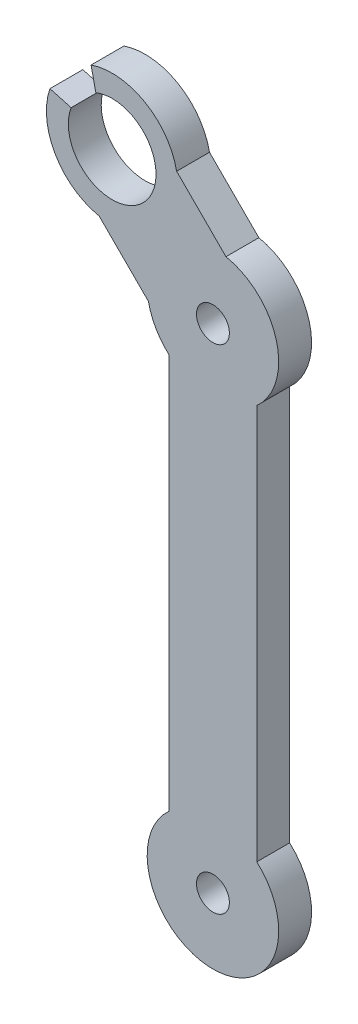
ISO-10303-21;
HEADER;
FILE_DESCRIPTION(('STEP AP214'),'2;1');
FILE_NAME('part.step','',(''),(''),'','','');
FILE_SCHEMA(('AUTOMOTIVE_DESIGN { 1 0 10303 214 1 1 1 1 }'));
ENDSEC;
DATA;
#1=APPLICATION_CONTEXT('core data for automotive mechanical design processes');
#2=APPLICATION_PROTOCOL_DEFINITION('international standard','automotive_design',2000,#1);
#3=PRODUCT_CONTEXT('',#1,'mechanical');
#4=PRODUCT('Part','Part','',(#3));
#5=PRODUCT_RELATED_PRODUCT_CATEGORY('part','',(#4));
#6=PRODUCT_DEFINITION_FORMATION('','',#4);
#7=PRODUCT_DEFINITION_CONTEXT('part definition',#1,'design');
#8=PRODUCT_DEFINITION('design','',#6,#7);
#9=PRODUCT_DEFINITION_SHAPE('','',#8);
#10=(LENGTH_UNIT() NAMED_UNIT(*) SI_UNIT(.MILLI.,.METRE.));
#11=(NAMED_UNIT(*) PLANE_ANGLE_UNIT() SI_UNIT($,.RADIAN.));
#12=(NAMED_UNIT(*) SI_UNIT($,.STERADIAN.) SOLID_ANGLE_UNIT());
#13=UNCERTAINTY_MEASURE_WITH_UNIT(LENGTH_MEASURE(1.E-05),#10,'distance_accuracy_value','');
#14=(GEOMETRIC_REPRESENTATION_CONTEXT(3) GLOBAL_UNCERTAINTY_ASSIGNED_CONTEXT((#13)) GLOBAL_UNIT_ASSIGNED_CONTEXT((#10,
#11,#12)) REPRESENTATION_CONTEXT('',''));
#15=CARTESIAN_POINT('',(0.,0.,0.));
#16=DIRECTION('',(0.,0.,1.));
#17=DIRECTION('',(1.,0.,0.));
#18=AXIS2_PLACEMENT_3D('',#15,#16,#17);
#19=CARTESIAN_POINT('',(0.,45.,3.));
#20=DIRECTION('',(0.,0.,-1.));
#21=DIRECTION('',(-1.,0.,0.));
#22=AXIS2_PLACEMENT_3D('',#19,#20,#21);
#23=CYLINDRICAL_SURFACE('',#22,6.);
#24=CARTESIAN_POINT('',(0.,45.,0.));
#25=DIRECTION('',(0.,0.,1.));
#26=DIRECTION('',(1.,0.,0.));
#27=AXIS2_PLACEMENT_3D('',#24,#25,#26);
#28=CIRCLE('',#27,6.);
#29=CARTESIAN_POINT('',(4.,40.5278640450004,0.));
#30=VERTEX_POINT('',#29);
#31=CARTESIAN_POINT('',(1.19032602602106,50.8807417858444,0.));
#32=VERTEX_POINT('',#31);
#33=EDGE_CURVE('E162',#30,#32,#28,.T.);
#34=ORIENTED_EDGE('',*,*,#33,.T.);
#35=DIRECTION('',(0.,0.,-1.));
#36=VECTOR('',#35,1.);
#37=CARTESIAN_POINT('',(1.19032602602106,50.8807417858444,3.));
#38=LINE('',#37,#36);
#39=CARTESIAN_POINT('',(1.19032602602106,50.8807417858444,3.));
#40=VERTEX_POINT('',#39);
#41=EDGE_CURVE('E11',#40,#32,#38,.T.);
#42=ORIENTED_EDGE('',*,*,#41,.F.);
#43=CARTESIAN_POINT('',(0.,45.,3.));
#44=DIRECTION('',(0.,0.,1.));
#45=DIRECTION('',(1.,0.,0.));
#46=AXIS2_PLACEMENT_3D('',#43,#44,#45);
#47=CIRCLE('',#46,6.);
#48=CARTESIAN_POINT('',(4.,40.5278640450004,3.));
#49=VERTEX_POINT('',#48);
#50=EDGE_CURVE('E102',#49,#40,#47,.T.);
#51=ORIENTED_EDGE('',*,*,#50,.F.);
#52=DIRECTION('',(0.,0.,-1.));
#53=VECTOR('',#52,1.);
#54=CARTESIAN_POINT('',(4.,40.5278640450004,3.));
#55=LINE('',#54,#53);
#56=EDGE_CURVE('E52',#49,#30,#55,.T.);
#57=ORIENTED_EDGE('',*,*,#56,.T.);
#58=EDGE_LOOP('',(#34,#42,#51,#57));
#59=FACE_BOUND('',#58,.T.);
#60=ADVANCED_FACE('F35',(#59),#23,.T.);
#61=CARTESIAN_POINT('',(26.0355339059327,26.0355339059354,3.));
#62=DIRECTION('',(0.70710678118651,0.707106781186585,0.));
#63=DIRECTION('',(-0.707106781186585,0.70710678118651,0.));
#64=AXIS2_PLACEMENT_3D('',#61,#62,#63);
#65=PLANE('',#64);
#66=DIRECTION('',(0.707106781186585,-0.70710678118651,0.));
#67=VECTOR('',#66,1.);
#68=CARTESIAN_POINT('',(26.0355339059327,26.0355339059354,0.));
#69=LINE('',#68,#67);
#70=CARTESIAN_POINT('',(-3.31164636958047,55.3827141814455,0.));
#71=VERTEX_POINT('',#70);
#72=EDGE_CURVE('E164',#71,#32,#69,.T.);
#73=ORIENTED_EDGE('',*,*,#72,.F.);
#74=DIRECTION('',(0.,0.,-1.));
#75=VECTOR('',#74,1.);
#76=CARTESIAN_POINT('',(-3.31164636958047,55.3827141814455,3.));
#77=LINE('',#76,#75);
#78=CARTESIAN_POINT('',(-3.31164636958047,55.3827141814455,3.));
#79=VERTEX_POINT('',#78);
#80=EDGE_CURVE('E44',#79,#71,#77,.T.);
#81=ORIENTED_EDGE('',*,*,#80,.F.);
#82=DIRECTION('',(0.707106781186585,-0.70710678118651,0.));
#83=VECTOR('',#82,1.);
#84=CARTESIAN_POINT('',(26.0355339059327,26.0355339059354,3.));
#85=LINE('',#84,#83);
#86=EDGE_CURVE('E223',#79,#40,#85,.T.);
#87=ORIENTED_EDGE('',*,*,#86,.T.);
#88=ORIENTED_EDGE('',*,*,#41,.T.);
#89=EDGE_LOOP('',(#73,#81,#87,#88));
#90=FACE_BOUND('',#89,.T.);
#91=ADVANCED_FACE('F222',(#90),#65,.T.);
#92=CARTESIAN_POINT('',(-9.19238815542507,54.1923881554252,3.));
#93=DIRECTION('',(0.,0.,-1.));
#94=DIRECTION('',(-1.,0.,0.));
#95=AXIS2_PLACEMENT_3D('',#92,#93,#94);
#96=CYLINDRICAL_SURFACE('',#95,6.);
#97=CARTESIAN_POINT('',(-9.19238815542507,54.1923881554252,0.));
#98=DIRECTION('',(0.,0.,1.));
#99=DIRECTION('',(1.,0.,0.));
#100=AXIS2_PLACEMENT_3D('',#97,#98,#99);
#101=CIRCLE('',#100,6.);
#102=CARTESIAN_POINT('',(-11.1157782971204,59.8757472293206,0.));
#103=VERTEX_POINT('',#102);
#104=EDGE_CURVE('E168',#71,#103,#101,.T.);
#105=ORIENTED_EDGE('',*,*,#104,.T.);
#106=DIRECTION('',(0.,0.,-1.));
#107=VECTOR('',#106,1.);
#108=CARTESIAN_POINT('',(-11.1157782971204,59.8757472293206,3.));
#109=LINE('',#108,#107);
#110=CARTESIAN_POINT('',(-11.1157782971204,59.8757472293206,3.));
#111=VERTEX_POINT('',#110);
#112=EDGE_CURVE('E208',#111,#103,#109,.T.);
#113=ORIENTED_EDGE('',*,*,#112,.F.);
#114=CARTESIAN_POINT('',(-9.19238815542507,54.1923881554252,3.));
#115=DIRECTION('',(0.,0.,1.));
#116=DIRECTION('',(1.,0.,0.));
#117=AXIS2_PLACEMENT_3D('',#114,#115,#116);
#118=CIRCLE('',#117,6.);
#119=EDGE_CURVE('E214',#79,#111,#118,.T.);
#120=ORIENTED_EDGE('',*,*,#119,.F.);
#121=ORIENTED_EDGE('',*,*,#80,.T.);
#122=EDGE_LOOP('',(#105,#113,#120,#121));
#123=FACE_BOUND('',#122,.T.);
#124=ADVANCED_FACE('F212',(#123),#96,.T.);
#125=CARTESIAN_POINT('',(1.95941500372976,0.430983798262829,3.));
#126=DIRECTION('',(-0.976653618125445,-0.214820181087524,0.));
#127=DIRECTION('',(0.214820181087524,-0.976653618125445,0.));
#128=AXIS2_PLACEMENT_3D('',#125,#126,#127);
#129=PLANE('',#128);
#130=DIRECTION('',(-0.214820181087524,0.976653618125445,0.));
#131=VECTOR('',#130,1.);
#132=CARTESIAN_POINT('',(1.95941500372976,0.430983798262829,0.));
#133=LINE('',#132,#131);
#134=CARTESIAN_POINT('',(-10.6822112754726,57.904587917153,0.));
#135=VERTEX_POINT('',#134);
#136=EDGE_CURVE('E171',#135,#103,#133,.T.);
#137=ORIENTED_EDGE('',*,*,#136,.F.);
#138=DIRECTION('',(0.,0.,-1.));
#139=VECTOR('',#138,1.);
#140=CARTESIAN_POINT('',(-10.6822112754726,57.904587917153,3.));
#141=LINE('',#140,#139);
#142=CARTESIAN_POINT('',(-10.6822112754726,57.904587917153,3.));
#143=VERTEX_POINT('',#142);
#144=EDGE_CURVE('E206',#143,#135,#141,.T.);
#145=ORIENTED_EDGE('',*,*,#144,.F.);
#146=DIRECTION('',(-0.214820181087524,0.976653618125445,0.));
#147=VECTOR('',#146,1.);
#148=CARTESIAN_POINT('',(1.95941500372976,0.430983798262829,3.));
#149=LINE('',#148,#147);
#150=EDGE_CURVE('E278',#143,#111,#149,.T.);
#151=ORIENTED_EDGE('',*,*,#150,.T.);
#152=ORIENTED_EDGE('',*,*,#112,.T.);
#153=EDGE_LOOP('',(#137,#145,#151,#152));
#154=FACE_BOUND('',#153,.T.);
#155=ADVANCED_FACE('F277',(#154),#129,.T.);
#156=CARTESIAN_POINT('',(-9.19238815542507,54.1923881554252,3.));
#157=DIRECTION('',(0.,0.,-1.));
#158=DIRECTION('',(-1.,0.,0.));
#159=AXIS2_PLACEMENT_3D('',#156,#157,#158);
#160=CYLINDRICAL_SURFACE('',#159,4.00000000000002);
#161=CARTESIAN_POINT('',(-9.19238815542507,54.1923881554252,0.));
#162=DIRECTION('',(0.,0.,1.));
#163=DIRECTION('',(1.,0.,0.));
#164=AXIS2_PLACEMENT_3D('',#161,#162,#163);
#165=CIRCLE('',#164,4.00000000000002);
#166=CARTESIAN_POINT('',(-12.939033762742,55.5933330840977,0.));
#167=VERTEX_POINT('',#166);
#168=EDGE_CURVE('E175',#167,#135,#165,.T.);
#169=ORIENTED_EDGE('',*,*,#168,.F.);
#170=DIRECTION('',(0.,0.,-1.));
#171=VECTOR('',#170,1.);
#172=CARTESIAN_POINT('',(-12.939033762742,55.5933330840977,3.));
#173=LINE('',#172,#171);
#174=CARTESIAN_POINT('',(-12.939033762742,55.5933330840977,3.));
#175=VERTEX_POINT('',#174);
#176=EDGE_CURVE('E204',#175,#167,#173,.T.);
#177=ORIENTED_EDGE('',*,*,#176,.F.);
#178=CARTESIAN_POINT('',(-9.19238815542507,54.1923881554252,3.));
#179=DIRECTION('',(0.,0.,1.));
#180=DIRECTION('',(1.,0.,0.));
#181=AXIS2_PLACEMENT_3D('',#178,#179,#180);
#182=CIRCLE('',#181,4.00000000000002);
#183=EDGE_CURVE('E273',#175,#143,#182,.T.);
#184=ORIENTED_EDGE('',*,*,#183,.T.);
#185=ORIENTED_EDGE('',*,*,#144,.T.);
#186=EDGE_LOOP('',(#169,#177,#184,#185));
#187=FACE_BOUND('',#186,.T.);
#188=ADVANCED_FACE('F271',(#187),#160,.F.);
#189=CARTESIAN_POINT('',(13.4340114359443,48.2504896577901,3.));
#190=DIRECTION('',(-0.268220227685939,-0.96335762282763,0.));
#191=DIRECTION('',(0.96335762282763,-0.268220227685939,0.));
#192=AXIS2_PLACEMENT_3D('',#189,#190,#191);
#193=PLANE('',#192);
#194=DIRECTION('',(-0.96335762282763,0.268220227685939,0.));
#195=VECTOR('',#194,1.);
#196=CARTESIAN_POINT('',(13.4340114359443,48.2504896577901,0.));
#197=LINE('',#196,#195);
#198=CARTESIAN_POINT('',(-14.8705367106971,56.1311065424692,0.));
#199=VERTEX_POINT('',#198);
#200=EDGE_CURVE('E178',#167,#199,#197,.T.);
#201=ORIENTED_EDGE('',*,*,#200,.T.);
#202=DIRECTION('',(0.,0.,-1.));
#203=VECTOR('',#202,1.);
#204=CARTESIAN_POINT('',(-14.8705367106971,56.1311065424692,3.));
#205=LINE('',#204,#203);
#206=CARTESIAN_POINT('',(-14.8705367106971,56.1311065424692,3.));
#207=VERTEX_POINT('',#206);
#208=EDGE_CURVE('E201',#207,#199,#205,.T.);
#209=ORIENTED_EDGE('',*,*,#208,.F.);
#210=DIRECTION('',(-0.96335762282763,0.268220227685939,0.));
#211=VECTOR('',#210,1.);
#212=CARTESIAN_POINT('',(13.4340114359443,48.2504896577901,3.));
#213=LINE('',#212,#211);
#214=EDGE_CURVE('E267',#175,#207,#213,.T.);
#215=ORIENTED_EDGE('',*,*,#214,.F.);
#216=ORIENTED_EDGE('',*,*,#176,.T.);
#217=EDGE_LOOP('',(#201,#209,#215,#216));
#218=FACE_BOUND('',#217,.T.);
#219=ADVANCED_FACE('F266',(#218),#193,.F.);
#220=CARTESIAN_POINT('',(-10.3827141814461,48.3116463695807,0.));
#221=VERTEX_POINT('',#220);
#222=EDGE_CURVE('E172',#199,#221,#101,.T.);
#223=ORIENTED_EDGE('',*,*,#222,.T.);
#224=DIRECTION('',(0.,0.,-1.));
#225=VECTOR('',#224,1.);
#226=CARTESIAN_POINT('',(-10.3827141814461,48.3116463695807,3.));
#227=LINE('',#226,#225);
#228=CARTESIAN_POINT('',(-10.3827141814461,48.3116463695807,3.));
#229=VERTEX_POINT('',#228);
#230=EDGE_CURVE('E198',#229,#221,#227,.T.);
#231=ORIENTED_EDGE('',*,*,#230,.F.);
#232=EDGE_CURVE('E262',#207,#229,#118,.T.);
#233=ORIENTED_EDGE('',*,*,#232,.F.);
#234=ORIENTED_EDGE('',*,*,#208,.T.);
#235=EDGE_LOOP('',(#223,#231,#233,#234));
#236=FACE_BOUND('',#235,.T.);
#237=ADVANCED_FACE('F250',(#236),#96,.T.);
#238=CARTESIAN_POINT('',(18.9644660940672,18.964466094067,3.));
#239=DIRECTION('',(0.707106781186552,0.707106781186543,0.));
#240=DIRECTION('',(-0.707106781186543,0.707106781186552,0.));
#241=AXIS2_PLACEMENT_3D('',#238,#239,#240);
#242=PLANE('',#241);
#243=DIRECTION('',(0.707106781186543,-0.707106781186552,0.));
#244=VECTOR('',#243,1.);
#245=CARTESIAN_POINT('',(18.9644660940672,18.964466094067,0.));
#246=LINE('',#245,#244);
#247=CARTESIAN_POINT('',(-5.88074178584446,43.809673973979,0.));
#248=VERTEX_POINT('',#247);
#249=EDGE_CURVE('E180',#221,#248,#246,.T.);
#250=ORIENTED_EDGE('',*,*,#249,.T.);
#251=DIRECTION('',(0.,0.,-1.));
#252=VECTOR('',#251,1.);
#253=CARTESIAN_POINT('',(-5.88074178584446,43.809673973979,3.));
#254=LINE('',#253,#252);
#255=CARTESIAN_POINT('',(-5.88074178584446,43.809673973979,3.));
#256=VERTEX_POINT('',#255);
#257=EDGE_CURVE('E195',#256,#248,#254,.T.);
#258=ORIENTED_EDGE('',*,*,#257,.F.);
#259=DIRECTION('',(0.707106781186543,-0.707106781186552,0.));
#260=VECTOR('',#259,1.);
#261=CARTESIAN_POINT('',(18.9644660940672,18.964466094067,3.));
#262=LINE('',#261,#260);
#263=EDGE_CURVE('E259',#229,#256,#262,.T.);
#264=ORIENTED_EDGE('',*,*,#263,.F.);
#265=ORIENTED_EDGE('',*,*,#230,.T.);
#266=EDGE_LOOP('',(#250,#258,#264,#265));
#267=FACE_BOUND('',#266,.T.);
#268=ADVANCED_FACE('F244',(#267),#242,.F.);
#269=CARTESIAN_POINT('',(-4.,40.5278640450004,0.));
#270=VERTEX_POINT('',#269);
#271=EDGE_CURVE('E165',#248,#270,#28,.T.);
#272=ORIENTED_EDGE('',*,*,#271,.T.);
#273=DIRECTION('',(0.,0.,-1.));
#274=VECTOR('',#273,1.);
#275=CARTESIAN_POINT('',(-4.,40.5278640450004,3.));
#276=LINE('',#275,#274);
#277=CARTESIAN_POINT('',(-4.,40.5278640450004,3.));
#278=VERTEX_POINT('',#277);
#279=EDGE_CURVE('E148',#278,#270,#276,.T.);
#280=ORIENTED_EDGE('',*,*,#279,.F.);
#281=EDGE_CURVE('E136',#256,#278,#47,.T.);
#282=ORIENTED_EDGE('',*,*,#281,.F.);
#283=ORIENTED_EDGE('',*,*,#257,.T.);
#284=EDGE_LOOP('',(#272,#280,#282,#283));
#285=FACE_BOUND('',#284,.T.);
#286=ADVANCED_FACE('F237',(#285),#23,.T.);
#287=CARTESIAN_POINT('',(-3.99999999999999,0.,3.));
#288=DIRECTION('',(1.,0.,0.));
#289=DIRECTION('',(0.,1.,0.));
#290=AXIS2_PLACEMENT_3D('',#287,#288,#289);
#291=PLANE('',#290);
#292=DIRECTION('',(0.,-1.,0.));
#293=VECTOR('',#292,1.);
#294=CARTESIAN_POINT('',(-3.99999999999999,0.,0.));
#295=LINE('',#294,#293);
#296=CARTESIAN_POINT('',(-3.99999999999999,4.47213595499959,0.));
#297=VERTEX_POINT('',#296);
#298=EDGE_CURVE('E145',#270,#297,#295,.T.);
#299=ORIENTED_EDGE('',*,*,#298,.T.);
#300=DIRECTION('',(0.,0.,-1.));
#301=VECTOR('',#300,1.);
#302=CARTESIAN_POINT('',(-3.99999999999999,4.47213595499959,3.));
#303=LINE('',#302,#301);
#304=CARTESIAN_POINT('',(-3.99999999999999,4.47213595499959,3.));
#305=VERTEX_POINT('',#304);
#306=EDGE_CURVE('E142',#305,#297,#303,.T.);
#307=ORIENTED_EDGE('',*,*,#306,.F.);
#308=DIRECTION('',(0.,-1.,0.));
#309=VECTOR('',#308,1.);
#310=CARTESIAN_POINT('',(-3.99999999999999,0.,3.));
#311=LINE('',#310,#309);
#312=EDGE_CURVE('E129',#278,#305,#311,.T.);
#313=ORIENTED_EDGE('',*,*,#312,.F.);
#314=ORIENTED_EDGE('',*,*,#279,.T.);
#315=EDGE_LOOP('',(#299,#307,#313,#314));
#316=FACE_BOUND('',#315,.T.);
#317=ADVANCED_FACE('F143',(#316),#291,.F.);
#318=CARTESIAN_POINT('',(0.,0.,3.));
#319=DIRECTION('',(0.,0.,-1.));
#320=DIRECTION('',(-1.,0.,0.));
#321=AXIS2_PLACEMENT_3D('',#318,#319,#320);
#322=CYLINDRICAL_SURFACE('',#321,6.);
#323=CARTESIAN_POINT('',(0.,0.,0.));
#324=DIRECTION('',(0.,0.,1.));
#325=DIRECTION('',(1.,0.,0.));
#326=AXIS2_PLACEMENT_3D('',#323,#324,#325);
#327=CIRCLE('',#326,6.);
#328=CARTESIAN_POINT('',(4.,4.47213595499958,0.));
#329=VERTEX_POINT('',#328);
#330=EDGE_CURVE('E183',#297,#329,#327,.T.);
#331=ORIENTED_EDGE('',*,*,#330,.T.);
#332=DIRECTION('',(0.,0.,-1.));
#333=VECTOR('',#332,1.);
#334=CARTESIAN_POINT('',(4.,4.47213595499958,3.));
#335=LINE('',#334,#333);
#336=CARTESIAN_POINT('',(4.,4.47213595499958,3.));
#337=VERTEX_POINT('',#336);
#338=EDGE_CURVE('E90',#337,#329,#335,.T.);
#339=ORIENTED_EDGE('',*,*,#338,.F.);
#340=CARTESIAN_POINT('',(0.,0.,3.));
#341=DIRECTION('',(0.,0.,1.));
#342=DIRECTION('',(1.,0.,0.));
#343=AXIS2_PLACEMENT_3D('',#340,#341,#342);
#344=CIRCLE('',#343,6.);
#345=EDGE_CURVE('E134',#305,#337,#344,.T.);
#346=ORIENTED_EDGE('',*,*,#345,.F.);
#347=ORIENTED_EDGE('',*,*,#306,.T.);
#348=EDGE_LOOP('',(#331,#339,#346,#347));
#349=FACE_BOUND('',#348,.T.);
#350=ADVANCED_FACE('F150',(#349),#322,.T.);
#351=CARTESIAN_POINT('',(4.,0.,3.));
#352=DIRECTION('',(1.,0.,0.));
#353=DIRECTION('',(0.,1.,0.));
#354=AXIS2_PLACEMENT_3D('',#351,#352,#353);
#355=PLANE('',#354);
#356=DIRECTION('',(0.,-1.,0.));
#357=VECTOR('',#356,1.);
#358=CARTESIAN_POINT('',(4.,0.,0.));
#359=LINE('',#358,#357);
#360=EDGE_CURVE('E185',#30,#329,#359,.T.);
#361=ORIENTED_EDGE('',*,*,#360,.F.);
#362=ORIENTED_EDGE('',*,*,#56,.F.);
#363=DIRECTION('',(0.,-1.,0.));
#364=VECTOR('',#363,1.);
#365=CARTESIAN_POINT('',(4.,0.,3.));
#366=LINE('',#365,#364);
#367=EDGE_CURVE('E151',#49,#337,#366,.T.);
#368=ORIENTED_EDGE('',*,*,#367,.T.);
#369=ORIENTED_EDGE('',*,*,#338,.T.);
#370=EDGE_LOOP('',(#361,#362,#368,#369));
#371=FACE_BOUND('',#370,.T.);
#372=ADVANCED_FACE('F224',(#371),#355,.T.);
#373=CARTESIAN_POINT('',(0.,45.,3.));
#374=DIRECTION('',(0.,0.,-1.));
#375=DIRECTION('',(-1.,0.,0.));
#376=AXIS2_PLACEMENT_3D('',#373,#374,#375);
#377=CYLINDRICAL_SURFACE('',#376,1.5);
#378=CARTESIAN_POINT('',(0.,45.,3.));
#379=DIRECTION('',(0.,0.,1.));
#380=DIRECTION('',(1.,0.,0.));
#381=AXIS2_PLACEMENT_3D('',#378,#379,#380);
#382=CIRCLE('',#381,1.5);
#383=CARTESIAN_POINT('',(1.5,45.,3.));
#384=VERTEX_POINT('',#383);
#385=EDGE_CURVE('E191',#384,#384,#382,.T.);
#386=ORIENTED_EDGE('',*,*,#385,.T.);
#387=EDGE_LOOP('',(#386));
#388=FACE_BOUND('',#387,.T.);
#389=CARTESIAN_POINT('',(0.,45.,0.));
#390=DIRECTION('',(0.,0.,1.));
#391=DIRECTION('',(1.,0.,0.));
#392=AXIS2_PLACEMENT_3D('',#389,#390,#391);
#393=CIRCLE('',#392,1.5);
#394=CARTESIAN_POINT('',(1.5,45.,0.));
#395=VERTEX_POINT('',#394);
#396=EDGE_CURVE('E159',#395,#395,#393,.T.);
#397=ORIENTED_EDGE('',*,*,#396,.F.);
#398=EDGE_LOOP('',(#397));
#399=FACE_BOUND('',#398,.T.);
#400=ADVANCED_FACE('F37',(#388,#399),#377,.F.);
#401=CARTESIAN_POINT('',(0.,0.,3.));
#402=DIRECTION('',(0.,0.,-1.));
#403=DIRECTION('',(-1.,0.,0.));
#404=AXIS2_PLACEMENT_3D('',#401,#402,#403);
#405=CYLINDRICAL_SURFACE('',#404,1.5);
#406=CARTESIAN_POINT('',(0.,0.,3.));
#407=DIRECTION('',(0.,0.,1.));
#408=DIRECTION('',(1.,0.,0.));
#409=AXIS2_PLACEMENT_3D('',#406,#407,#408);
#410=CIRCLE('',#409,1.5);
#411=CARTESIAN_POINT('',(1.5,0.,3.));
#412=VERTEX_POINT('',#411);
#413=EDGE_CURVE('E153',#412,#412,#410,.T.);
#414=ORIENTED_EDGE('',*,*,#413,.T.);
#415=EDGE_LOOP('',(#414));
#416=FACE_BOUND('',#415,.T.);
#417=CARTESIAN_POINT('',(0.,0.,0.));
#418=DIRECTION('',(0.,0.,1.));
#419=DIRECTION('',(1.,0.,0.));
#420=AXIS2_PLACEMENT_3D('',#417,#418,#419);
#421=CIRCLE('',#420,1.5);
#422=CARTESIAN_POINT('',(1.5,0.,0.));
#423=VERTEX_POINT('',#422);
#424=EDGE_CURVE('E188',#423,#423,#421,.T.);
#425=ORIENTED_EDGE('',*,*,#424,.F.);
#426=EDGE_LOOP('',(#425));
#427=FACE_BOUND('',#426,.T.);
#428=ADVANCED_FACE('F231',(#416,#427),#405,.F.);
#429=CARTESIAN_POINT('',(0.,0.,3.));
#430=DIRECTION('',(0.,0.,1.));
#431=DIRECTION('',(1.,0.,0.));
#432=AXIS2_PLACEMENT_3D('',#429,#430,#431);
#433=PLANE('',#432);
#434=ORIENTED_EDGE('',*,*,#385,.F.);
#435=EDGE_LOOP('',(#434));
#436=FACE_BOUND('',#435,.T.);
#437=ORIENTED_EDGE('',*,*,#50,.T.);
#438=ORIENTED_EDGE('',*,*,#86,.F.);
#439=ORIENTED_EDGE('',*,*,#119,.T.);
#440=ORIENTED_EDGE('',*,*,#150,.F.);
#441=ORIENTED_EDGE('',*,*,#183,.F.);
#442=ORIENTED_EDGE('',*,*,#214,.T.);
#443=ORIENTED_EDGE('',*,*,#232,.T.);
#444=ORIENTED_EDGE('',*,*,#263,.T.);
#445=ORIENTED_EDGE('',*,*,#281,.T.);
#446=ORIENTED_EDGE('',*,*,#312,.T.);
#447=ORIENTED_EDGE('',*,*,#345,.T.);
#448=ORIENTED_EDGE('',*,*,#367,.F.);
#449=EDGE_LOOP('',(#437,#438,#439,#440,#441,#442,#443,#444,#445,#446,#447,#448));
#450=FACE_BOUND('',#449,.T.);
#451=ORIENTED_EDGE('',*,*,#413,.F.);
#452=EDGE_LOOP('',(#451));
#453=FACE_BOUND('',#452,.T.);
#454=ADVANCED_FACE('F131',(#436,#450,#453),#433,.T.);
#455=CARTESIAN_POINT('',(0.,0.,0.));
#456=DIRECTION('',(0.,0.,1.));
#457=DIRECTION('',(1.,0.,0.));
#458=AXIS2_PLACEMENT_3D('',#455,#456,#457);
#459=PLANE('',#458);
#460=ORIENTED_EDGE('',*,*,#396,.T.);
#461=EDGE_LOOP('',(#460));
#462=FACE_BOUND('',#461,.T.);
#463=ORIENTED_EDGE('',*,*,#33,.F.);
#464=ORIENTED_EDGE('',*,*,#360,.T.);
#465=ORIENTED_EDGE('',*,*,#330,.F.);
#466=ORIENTED_EDGE('',*,*,#298,.F.);
#467=ORIENTED_EDGE('',*,*,#271,.F.);
#468=ORIENTED_EDGE('',*,*,#249,.F.);
#469=ORIENTED_EDGE('',*,*,#222,.F.);
#470=ORIENTED_EDGE('',*,*,#200,.F.);
#471=ORIENTED_EDGE('',*,*,#168,.T.);
#472=ORIENTED_EDGE('',*,*,#136,.T.);
#473=ORIENTED_EDGE('',*,*,#104,.F.);
#474=ORIENTED_EDGE('',*,*,#72,.T.);
#475=EDGE_LOOP('',(#463,#464,#465,#466,#467,#468,#469,#470,#471,#472,#473,#474));
#476=FACE_BOUND('',#475,.T.);
#477=ORIENTED_EDGE('',*,*,#424,.T.);
#478=EDGE_LOOP('',(#477));
#479=FACE_BOUND('',#478,.T.);
#480=ADVANCED_FACE('F219',(#462,#476,#479),#459,.F.);
#481=CLOSED_SHELL('',(#60,#91,#124,#155,#188,#219,#237,#268,#286,#317,#350,#372,#400,#428,#454,#480));
#482=MANIFOLD_SOLID_BREP('B2',#481);
#483=ADVANCED_BREP_SHAPE_REPRESENTATION('',(#18,#482),#14);
#484=SHAPE_DEFINITION_REPRESENTATION(#9,#483);
ENDSEC;
END-ISO-10303-21;
